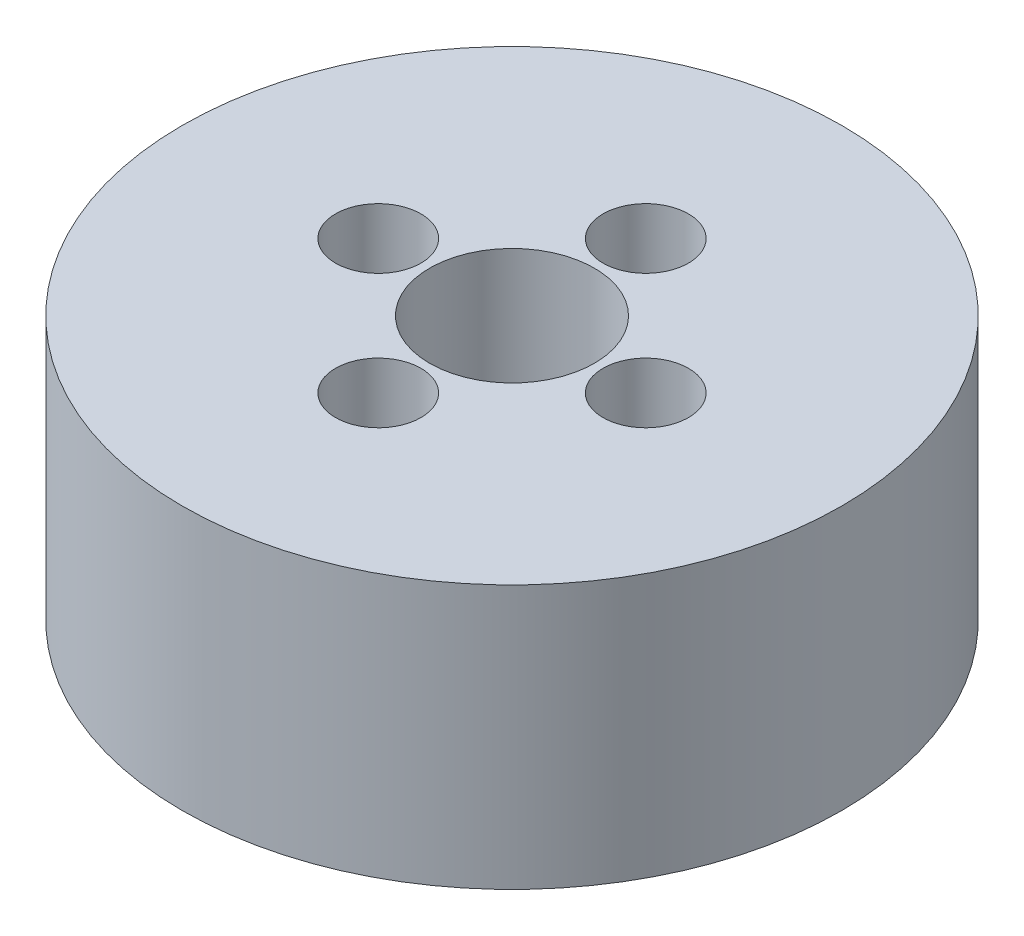
ISO-10303-21;
HEADER;
FILE_DESCRIPTION(('STEP AP214'),'2;1');
FILE_NAME('part.step','',(''),(''),'','','');
FILE_SCHEMA(('AUTOMOTIVE_DESIGN { 1 0 10303 214 1 1 1 1 }'));
ENDSEC;
DATA;
#1=APPLICATION_CONTEXT('core data for automotive mechanical design processes');
#2=APPLICATION_PROTOCOL_DEFINITION('international standard','automotive_design',2000,#1);
#3=PRODUCT_CONTEXT('',#1,'mechanical');
#4=PRODUCT('Part','Part','',(#3));
#5=PRODUCT_RELATED_PRODUCT_CATEGORY('part','',(#4));
#6=PRODUCT_DEFINITION_FORMATION('','',#4);
#7=PRODUCT_DEFINITION_CONTEXT('part definition',#1,'design');
#8=PRODUCT_DEFINITION('design','',#6,#7);
#9=PRODUCT_DEFINITION_SHAPE('','',#8);
#10=(LENGTH_UNIT() NAMED_UNIT(*) SI_UNIT(.MILLI.,.METRE.));
#11=(NAMED_UNIT(*) PLANE_ANGLE_UNIT() SI_UNIT($,.RADIAN.));
#12=(NAMED_UNIT(*) SI_UNIT($,.STERADIAN.) SOLID_ANGLE_UNIT());
#13=UNCERTAINTY_MEASURE_WITH_UNIT(LENGTH_MEASURE(1.E-05),#10,'distance_accuracy_value','');
#14=(GEOMETRIC_REPRESENTATION_CONTEXT(3) GLOBAL_UNCERTAINTY_ASSIGNED_CONTEXT((#13)) GLOBAL_UNIT_ASSIGNED_CONTEXT((#10,
#11,#12)) REPRESENTATION_CONTEXT('',''));
#15=CARTESIAN_POINT('',(0.,0.,0.));
#16=DIRECTION('',(0.,0.,1.));
#17=DIRECTION('',(1.,0.,0.));
#18=AXIS2_PLACEMENT_3D('',#15,#16,#17);
#19=CARTESIAN_POINT('',(0.,24.,0.));
#20=DIRECTION('',(0.,-1.,0.));
#21=DIRECTION('',(0.,0.,-1.));
#22=AXIS2_PLACEMENT_3D('',#19,#20,#21);
#23=CYLINDRICAL_SURFACE('',#22,30.);
#24=CARTESIAN_POINT('',(0.,24.,0.));
#25=DIRECTION('',(0.,1.,0.));
#26=DIRECTION('',(0.,0.,1.));
#27=AXIS2_PLACEMENT_3D('',#24,#25,#26);
#28=CIRCLE('',#27,30.);
#29=CARTESIAN_POINT('',(0.,24.,30.));
#30=VERTEX_POINT('',#29);
#31=EDGE_CURVE('E10',#30,#30,#28,.T.);
#32=ORIENTED_EDGE('',*,*,#31,.F.);
#33=EDGE_LOOP('',(#32));
#34=FACE_BOUND('',#33,.T.);
#35=CARTESIAN_POINT('',(0.,0.,0.));
#36=DIRECTION('',(0.,1.,0.));
#37=DIRECTION('',(0.,0.,1.));
#38=AXIS2_PLACEMENT_3D('',#35,#36,#37);
#39=CIRCLE('',#38,30.);
#40=CARTESIAN_POINT('',(0.,0.,30.));
#41=VERTEX_POINT('',#40);
#42=EDGE_CURVE('E37',#41,#41,#39,.T.);
#43=ORIENTED_EDGE('',*,*,#42,.T.);
#44=EDGE_LOOP('',(#43));
#45=FACE_BOUND('',#44,.T.);
#46=ADVANCED_FACE('F40',(#34,#45),#23,.T.);
#47=CARTESIAN_POINT('',(0.,24.,0.));
#48=DIRECTION('',(0.,1.,0.));
#49=DIRECTION('',(0.,0.,1.));
#50=AXIS2_PLACEMENT_3D('',#47,#48,#49);
#51=PLANE('',#50);
#52=CARTESIAN_POINT('',(0.,24.,12.1704910490633));
#53=DIRECTION('',(0.,1.,0.));
#54=DIRECTION('',(1.,0.,0.));
#55=AXIS2_PLACEMENT_3D('',#52,#53,#54);
#56=CIRCLE('',#55,3.8873329559594);
#57=CARTESIAN_POINT('',(3.88733295595945,24.,12.1704910490633));
#58=VERTEX_POINT('',#57);
#59=EDGE_CURVE('E71',#58,#58,#56,.T.);
#60=ORIENTED_EDGE('',*,*,#59,.F.);
#61=EDGE_LOOP('',(#60));
#62=FACE_BOUND('',#61,.T.);
#63=CARTESIAN_POINT('',(12.1704910490633,24.,0.));
#64=DIRECTION('',(0.,1.,0.));
#65=DIRECTION('',(0.,0.,-1.));
#66=AXIS2_PLACEMENT_3D('',#63,#64,#65);
#67=CIRCLE('',#66,3.8873329559594);
#68=CARTESIAN_POINT('',(12.1704910490633,24.,-3.8873329559594));
#69=VERTEX_POINT('',#68);
#70=EDGE_CURVE('E70',#69,#69,#67,.T.);
#71=ORIENTED_EDGE('',*,*,#70,.F.);
#72=EDGE_LOOP('',(#71));
#73=FACE_BOUND('',#72,.T.);
#74=CARTESIAN_POINT('',(-1.27479127147086E-13,24.,-12.1704910490633));
#75=DIRECTION('',(0.,1.,0.));
#76=DIRECTION('',(-1.,0.,0.));
#77=AXIS2_PLACEMENT_3D('',#74,#75,#76);
#78=CIRCLE('',#77,3.8873329559594);
#79=CARTESIAN_POINT('',(-3.88733295595953,24.,-12.1704910490633));
#80=VERTEX_POINT('',#79);
#81=EDGE_CURVE('E61',#80,#80,#78,.T.);
#82=ORIENTED_EDGE('',*,*,#81,.F.);
#83=EDGE_LOOP('',(#82));
#84=FACE_BOUND('',#83,.T.);
#85=CARTESIAN_POINT('',(-12.1704910490633,24.,0.));
#86=DIRECTION('',(0.,1.,0.));
#87=DIRECTION('',(0.,0.,1.));
#88=AXIS2_PLACEMENT_3D('',#85,#86,#87);
#89=CIRCLE('',#88,3.8873329559594);
#90=CARTESIAN_POINT('',(-12.1704910490633,24.,3.8873329559594));
#91=VERTEX_POINT('',#90);
#92=EDGE_CURVE('E54',#91,#91,#89,.T.);
#93=ORIENTED_EDGE('',*,*,#92,.F.);
#94=EDGE_LOOP('',(#93));
#95=FACE_BOUND('',#94,.T.);
#96=CARTESIAN_POINT('',(0.,24.,0.));
#97=DIRECTION('',(0.,1.,0.));
#98=DIRECTION('',(0.,0.,1.));
#99=AXIS2_PLACEMENT_3D('',#96,#97,#98);
#100=CIRCLE('',#99,7.5);
#101=CARTESIAN_POINT('',(0.,24.,7.5));
#102=VERTEX_POINT('',#101);
#103=EDGE_CURVE('E50',#102,#102,#100,.T.);
#104=ORIENTED_EDGE('',*,*,#103,.F.);
#105=EDGE_LOOP('',(#104));
#106=FACE_BOUND('',#105,.T.);
#107=ORIENTED_EDGE('',*,*,#31,.T.);
#108=EDGE_LOOP('',(#107));
#109=FACE_BOUND('',#108,.T.);
#110=ADVANCED_FACE('F86',(#62,#73,#84,#95,#106,#109),#51,.T.);
#111=CARTESIAN_POINT('',(0.,0.,0.));
#112=DIRECTION('',(0.,1.,0.));
#113=DIRECTION('',(0.,0.,1.));
#114=AXIS2_PLACEMENT_3D('',#111,#112,#113);
#115=PLANE('',#114);
#116=CARTESIAN_POINT('',(0.,0.,0.));
#117=DIRECTION('',(0.,1.,0.));
#118=DIRECTION('',(0.,0.,1.));
#119=AXIS2_PLACEMENT_3D('',#116,#117,#118);
#120=CIRCLE('',#119,7.5);
#121=CARTESIAN_POINT('',(0.,0.,7.5));
#122=VERTEX_POINT('',#121);
#123=EDGE_CURVE('E47',#122,#122,#120,.T.);
#124=ORIENTED_EDGE('',*,*,#123,.T.);
#125=EDGE_LOOP('',(#124));
#126=FACE_BOUND('',#125,.T.);
#127=ORIENTED_EDGE('',*,*,#42,.F.);
#128=EDGE_LOOP('',(#127));
#129=FACE_BOUND('',#128,.T.);
#130=ADVANCED_FACE('F93',(#126,#129),#115,.F.);
#131=CARTESIAN_POINT('',(0.,24.,0.));
#132=DIRECTION('',(0.,-1.,0.));
#133=DIRECTION('',(0.,0.,-1.));
#134=AXIS2_PLACEMENT_3D('',#131,#132,#133);
#135=CYLINDRICAL_SURFACE('',#134,7.5);
#136=ORIENTED_EDGE('',*,*,#103,.T.);
#137=EDGE_LOOP('',(#136));
#138=FACE_BOUND('',#137,.T.);
#139=ORIENTED_EDGE('',*,*,#123,.F.);
#140=EDGE_LOOP('',(#139));
#141=FACE_BOUND('',#140,.T.);
#142=ADVANCED_FACE('F101',(#138,#141),#135,.F.);
#143=CARTESIAN_POINT('',(-12.1704910490633,1.98452351169319,0.));
#144=DIRECTION('',(0.,1.,0.));
#145=DIRECTION('',(0.,0.,1.));
#146=AXIS2_PLACEMENT_3D('',#143,#144,#145);
#147=CYLINDRICAL_SURFACE('',#146,3.8873329559594);
#148=CARTESIAN_POINT('',(-12.1704910490633,1.98452351169319,0.));
#149=DIRECTION('',(0.,1.,0.));
#150=DIRECTION('',(0.,0.,1.));
#151=AXIS2_PLACEMENT_3D('',#148,#149,#150);
#152=CIRCLE('',#151,3.8873329559594);
#153=CARTESIAN_POINT('',(-12.1704910490633,1.98452351169319,3.8873329559594));
#154=VERTEX_POINT('',#153);
#155=EDGE_CURVE('E55',#154,#154,#152,.T.);
#156=ORIENTED_EDGE('',*,*,#155,.F.);
#157=EDGE_LOOP('',(#156));
#158=FACE_BOUND('',#157,.T.);
#159=ORIENTED_EDGE('',*,*,#92,.T.);
#160=EDGE_LOOP('',(#159));
#161=FACE_BOUND('',#160,.T.);
#162=ADVANCED_FACE('F102',(#158,#161),#147,.F.);
#163=CARTESIAN_POINT('',(-12.1704910490633,1.98452351169319,0.));
#164=DIRECTION('',(0.,1.,0.));
#165=DIRECTION('',(0.,0.,1.));
#166=AXIS2_PLACEMENT_3D('',#163,#164,#165);
#167=PLANE('',#166);
#168=ORIENTED_EDGE('',*,*,#155,.T.);
#169=EDGE_LOOP('',(#168));
#170=FACE_BOUND('',#169,.T.);
#171=ADVANCED_FACE('F133',(#170),#167,.T.);
#172=CARTESIAN_POINT('',(-1.27479127147086E-13,1.98452351169319,-12.1704910490633));
#173=DIRECTION('',(0.,1.,0.));
#174=DIRECTION('',(0.,0.,1.));
#175=AXIS2_PLACEMENT_3D('',#172,#173,#174);
#176=CYLINDRICAL_SURFACE('',#175,3.8873329559594);
#177=CARTESIAN_POINT('',(-1.27479127147086E-13,1.98452351169319,-12.1704910490633));
#178=DIRECTION('',(0.,1.,0.));
#179=DIRECTION('',(-1.,0.,0.));
#180=AXIS2_PLACEMENT_3D('',#177,#178,#179);
#181=CIRCLE('',#180,3.8873329559594);
#182=CARTESIAN_POINT('',(-3.88733295595953,1.98452351169319,-12.1704910490633));
#183=VERTEX_POINT('',#182);
#184=EDGE_CURVE('E63',#183,#183,#181,.T.);
#185=ORIENTED_EDGE('',*,*,#184,.F.);
#186=EDGE_LOOP('',(#185));
#187=FACE_BOUND('',#186,.T.);
#188=ORIENTED_EDGE('',*,*,#81,.T.);
#189=EDGE_LOOP('',(#188));
#190=FACE_BOUND('',#189,.T.);
#191=ADVANCED_FACE('F142',(#187,#190),#176,.F.);
#192=CARTESIAN_POINT('',(-1.27479127147086E-13,1.98452351169319,-12.1704910490633));
#193=DIRECTION('',(0.,1.,0.));
#194=DIRECTION('',(-1.,0.,0.));
#195=AXIS2_PLACEMENT_3D('',#192,#193,#194);
#196=PLANE('',#195);
#197=ORIENTED_EDGE('',*,*,#184,.T.);
#198=EDGE_LOOP('',(#197));
#199=FACE_BOUND('',#198,.T.);
#200=ADVANCED_FACE('F156',(#199),#196,.T.);
#201=CARTESIAN_POINT('',(12.1704910490633,1.98452351169319,0.));
#202=DIRECTION('',(0.,1.,0.));
#203=DIRECTION('',(0.,0.,1.));
#204=AXIS2_PLACEMENT_3D('',#201,#202,#203);
#205=CYLINDRICAL_SURFACE('',#204,3.8873329559594);
#206=CARTESIAN_POINT('',(12.1704910490633,1.98452351169319,0.));
#207=DIRECTION('',(0.,1.,0.));
#208=DIRECTION('',(0.,0.,-1.));
#209=AXIS2_PLACEMENT_3D('',#206,#207,#208);
#210=CIRCLE('',#209,3.8873329559594);
#211=CARTESIAN_POINT('',(12.1704910490633,1.98452351169319,-3.8873329559594));
#212=VERTEX_POINT('',#211);
#213=EDGE_CURVE('E69',#212,#212,#210,.T.);
#214=ORIENTED_EDGE('',*,*,#213,.F.);
#215=EDGE_LOOP('',(#214));
#216=FACE_BOUND('',#215,.T.);
#217=ORIENTED_EDGE('',*,*,#70,.T.);
#218=EDGE_LOOP('',(#217));
#219=FACE_BOUND('',#218,.T.);
#220=ADVANCED_FACE('F164',(#216,#219),#205,.F.);
#221=CARTESIAN_POINT('',(12.1704910490633,1.98452351169319,0.));
#222=DIRECTION('',(0.,1.,0.));
#223=DIRECTION('',(0.,0.,-1.));
#224=AXIS2_PLACEMENT_3D('',#221,#222,#223);
#225=PLANE('',#224);
#226=ORIENTED_EDGE('',*,*,#213,.T.);
#227=EDGE_LOOP('',(#226));
#228=FACE_BOUND('',#227,.T.);
#229=ADVANCED_FACE('F83',(#228),#225,.T.);
#230=CARTESIAN_POINT('',(0.,1.98452351169319,12.1704910490633));
#231=DIRECTION('',(0.,1.,0.));
#232=DIRECTION('',(0.,0.,1.));
#233=AXIS2_PLACEMENT_3D('',#230,#231,#232);
#234=CYLINDRICAL_SURFACE('',#233,3.8873329559594);
#235=CARTESIAN_POINT('',(0.,1.98452351169319,12.1704910490633));
#236=DIRECTION('',(0.,1.,0.));
#237=DIRECTION('',(1.,0.,0.));
#238=AXIS2_PLACEMENT_3D('',#235,#236,#237);
#239=CIRCLE('',#238,3.8873329559594);
#240=CARTESIAN_POINT('',(3.88733295595945,1.98452351169319,12.1704910490633));
#241=VERTEX_POINT('',#240);
#242=EDGE_CURVE('E59',#241,#241,#239,.T.);
#243=ORIENTED_EDGE('',*,*,#242,.F.);
#244=EDGE_LOOP('',(#243));
#245=FACE_BOUND('',#244,.T.);
#246=ORIENTED_EDGE('',*,*,#59,.T.);
#247=EDGE_LOOP('',(#246));
#248=FACE_BOUND('',#247,.T.);
#249=ADVANCED_FACE('F81',(#245,#248),#234,.F.);
#250=CARTESIAN_POINT('',(0.,1.98452351169319,12.1704910490633));
#251=DIRECTION('',(0.,1.,0.));
#252=DIRECTION('',(1.,0.,0.));
#253=AXIS2_PLACEMENT_3D('',#250,#251,#252);
#254=PLANE('',#253);
#255=ORIENTED_EDGE('',*,*,#242,.T.);
#256=EDGE_LOOP('',(#255));
#257=FACE_BOUND('',#256,.T.);
#258=ADVANCED_FACE('F78',(#257),#254,.T.);
#259=CLOSED_SHELL('',(#46,#110,#130,#142,#162,#171,#191,#200,#220,#229,#249,#258));
#260=MANIFOLD_SOLID_BREP('B2',#259);
#261=ADVANCED_BREP_SHAPE_REPRESENTATION('',(#18,#260),#14);
#262=SHAPE_DEFINITION_REPRESENTATION(#9,#261);
ENDSEC;
END-ISO-10303-21;
